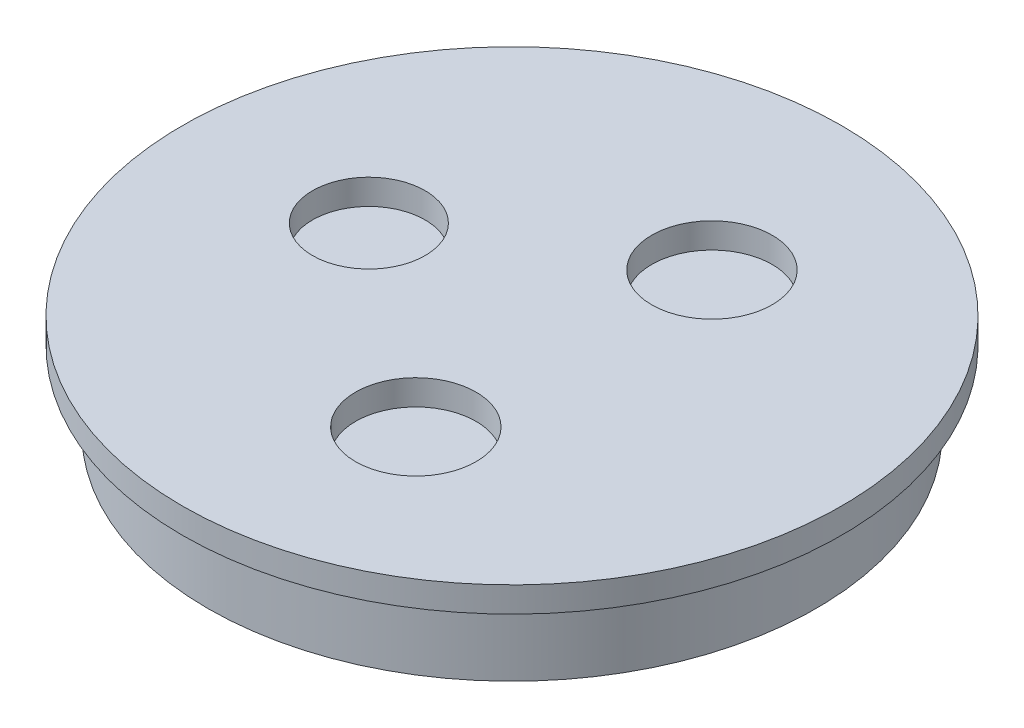
ISO-10303-21;
HEADER;
FILE_DESCRIPTION(('STEP AP214'),'2;1');
FILE_NAME('part.step','',(''),(''),'','','');
FILE_SCHEMA(('AUTOMOTIVE_DESIGN { 1 0 10303 214 1 1 1 1 }'));
ENDSEC;
DATA;
#1=APPLICATION_CONTEXT('core data for automotive mechanical design processes');
#2=APPLICATION_PROTOCOL_DEFINITION('international standard','automotive_design',2000,#1);
#3=PRODUCT_CONTEXT('',#1,'mechanical');
#4=PRODUCT('Part','Part','',(#3));
#5=PRODUCT_RELATED_PRODUCT_CATEGORY('part','',(#4));
#6=PRODUCT_DEFINITION_FORMATION('','',#4);
#7=PRODUCT_DEFINITION_CONTEXT('part definition',#1,'design');
#8=PRODUCT_DEFINITION('design','',#6,#7);
#9=PRODUCT_DEFINITION_SHAPE('','',#8);
#10=(LENGTH_UNIT() NAMED_UNIT(*) SI_UNIT(.MILLI.,.METRE.));
#11=(NAMED_UNIT(*) PLANE_ANGLE_UNIT() SI_UNIT($,.RADIAN.));
#12=(NAMED_UNIT(*) SI_UNIT($,.STERADIAN.) SOLID_ANGLE_UNIT());
#13=UNCERTAINTY_MEASURE_WITH_UNIT(LENGTH_MEASURE(1.E-05),#10,'distance_accuracy_value','');
#14=(GEOMETRIC_REPRESENTATION_CONTEXT(3) GLOBAL_UNCERTAINTY_ASSIGNED_CONTEXT((#13)) GLOBAL_UNIT_ASSIGNED_CONTEXT((#10,
#11,#12)) REPRESENTATION_CONTEXT('',''));
#15=CARTESIAN_POINT('',(0.,0.,0.));
#16=DIRECTION('',(0.,0.,1.));
#17=DIRECTION('',(1.,0.,0.));
#18=AXIS2_PLACEMENT_3D('',#15,#16,#17);
#19=CARTESIAN_POINT('',(0.,0.,0.));
#20=DIRECTION('',(0.,1.,0.));
#21=DIRECTION('',(0.,0.,1.));
#22=AXIS2_PLACEMENT_3D('',#19,#20,#21);
#23=PLANE('',#22);
#24=CARTESIAN_POINT('',(0.,0.,0.));
#25=DIRECTION('',(0.,1.,0.));
#26=DIRECTION('',(0.,0.,1.));
#27=AXIS2_PLACEMENT_3D('',#24,#25,#26);
#28=CIRCLE('',#27,41.275);
#29=CARTESIAN_POINT('',(0.,0.,41.275));
#30=VERTEX_POINT('',#29);
#31=EDGE_CURVE('E42',#30,#30,#28,.T.);
#32=ORIENTED_EDGE('',*,*,#31,.F.);
#33=EDGE_LOOP('',(#32));
#34=FACE_BOUND('',#33,.T.);
#35=CARTESIAN_POINT('',(0.,0.,0.));
#36=DIRECTION('',(0.,1.,0.));
#37=DIRECTION('',(0.,0.,1.));
#38=AXIS2_PLACEMENT_3D('',#35,#36,#37);
#39=CIRCLE('',#38,38.1);
#40=CARTESIAN_POINT('',(0.,0.,38.1));
#41=VERTEX_POINT('',#40);
#42=EDGE_CURVE('E10',#41,#41,#39,.F.);
#43=ORIENTED_EDGE('',*,*,#42,.F.);
#44=EDGE_LOOP('',(#43));
#45=FACE_BOUND('',#44,.T.);
#46=ADVANCED_FACE('F31',(#34,#45),#23,.F.);
#47=CARTESIAN_POINT('',(0.,3.175,0.));
#48=DIRECTION('',(0.,1.,0.));
#49=DIRECTION('',(0.,0.,1.));
#50=AXIS2_PLACEMENT_3D('',#47,#48,#49);
#51=PLANE('',#50);
#52=CARTESIAN_POINT('',(6.02571844219513,3.175,18.0718902513099));
#53=DIRECTION('',(0.,1.,0.));
#54=DIRECTION('',(0.,0.,1.));
#55=AXIS2_PLACEMENT_3D('',#52,#53,#54);
#56=CIRCLE('',#55,7.55);
#57=CARTESIAN_POINT('',(6.02571844219513,3.175,25.6218902513099));
#58=VERTEX_POINT('',#57);
#59=EDGE_CURVE('E52',#58,#58,#56,.T.);
#60=ORIENTED_EDGE('',*,*,#59,.F.);
#61=EDGE_LOOP('',(#60));
#62=FACE_BOUND('',#61,.T.);
#63=CARTESIAN_POINT('',(0.,3.175,0.));
#64=DIRECTION('',(0.,1.,0.));
#65=DIRECTION('',(0.,0.,1.));
#66=AXIS2_PLACEMENT_3D('',#63,#64,#65);
#67=CIRCLE('',#66,41.275);
#68=CARTESIAN_POINT('',(0.,3.175,41.275));
#69=VERTEX_POINT('',#68);
#70=EDGE_CURVE('E38',#69,#69,#67,.T.);
#71=ORIENTED_EDGE('',*,*,#70,.T.);
#72=EDGE_LOOP('',(#71));
#73=FACE_BOUND('',#72,.T.);
#74=CARTESIAN_POINT('',(-19.0188478283971,3.175,-1.08900288350165));
#75=DIRECTION('',(0.,1.,0.));
#76=DIRECTION('',(0.,0.,1.));
#77=AXIS2_PLACEMENT_3D('',#74,#75,#76);
#78=CIRCLE('',#77,7.05);
#79=CARTESIAN_POINT('',(-19.0188478283971,3.175,5.96099711649835));
#80=VERTEX_POINT('',#79);
#81=EDGE_CURVE('E47',#80,#80,#78,.T.);
#82=ORIENTED_EDGE('',*,*,#81,.F.);
#83=EDGE_LOOP('',(#82));
#84=FACE_BOUND('',#83,.T.);
#85=CARTESIAN_POINT('',(7.55083057647846,3.175,-17.4896385784646));
#86=DIRECTION('',(0.,1.,0.));
#87=DIRECTION('',(0.,0.,1.));
#88=AXIS2_PLACEMENT_3D('',#85,#86,#87);
#89=CIRCLE('',#88,7.55);
#90=CARTESIAN_POINT('',(7.55083057647846,3.175,-9.93963857846462));
#91=VERTEX_POINT('',#90);
#92=EDGE_CURVE('E58',#91,#91,#89,.T.);
#93=ORIENTED_EDGE('',*,*,#92,.F.);
#94=EDGE_LOOP('',(#93));
#95=FACE_BOUND('',#94,.T.);
#96=ADVANCED_FACE('F87',(#62,#73,#84,#95),#51,.T.);
#97=CARTESIAN_POINT('',(0.,3.175,0.));
#98=DIRECTION('',(0.,-1.,0.));
#99=DIRECTION('',(0.,0.,-1.));
#100=AXIS2_PLACEMENT_3D('',#97,#98,#99);
#101=CYLINDRICAL_SURFACE('',#100,41.275);
#102=ORIENTED_EDGE('',*,*,#70,.F.);
#103=EDGE_LOOP('',(#102));
#104=FACE_BOUND('',#103,.T.);
#105=ORIENTED_EDGE('',*,*,#31,.T.);
#106=EDGE_LOOP('',(#105));
#107=FACE_BOUND('',#106,.T.);
#108=ADVANCED_FACE('F33',(#104,#107),#101,.T.);
#109=CARTESIAN_POINT('',(-19.0188478283971,3.175,-1.08900288350165));
#110=DIRECTION('',(0.,-1.,0.));
#111=DIRECTION('',(0.,0.,-1.));
#112=AXIS2_PLACEMENT_3D('',#109,#110,#111);
#113=CYLINDRICAL_SURFACE('',#112,7.05);
#114=ORIENTED_EDGE('',*,*,#81,.T.);
#115=EDGE_LOOP('',(#114));
#116=FACE_BOUND('',#115,.T.);
#117=CARTESIAN_POINT('',(-19.0188478283971,0.,-1.08900288350165));
#118=DIRECTION('',(0.,1.,0.));
#119=DIRECTION('',(0.,0.,1.));
#120=AXIS2_PLACEMENT_3D('',#117,#118,#119);
#121=CIRCLE('',#120,7.05);
#122=CARTESIAN_POINT('',(-19.0188478283971,0.,5.96099711649835));
#123=VERTEX_POINT('',#122);
#124=EDGE_CURVE('E49',#123,#123,#121,.T.);
#125=ORIENTED_EDGE('',*,*,#124,.F.);
#126=EDGE_LOOP('',(#125));
#127=FACE_BOUND('',#126,.T.);
#128=ADVANCED_FACE('F97',(#116,#127),#113,.F.);
#129=CARTESIAN_POINT('',(6.02571844219513,3.175,18.0718902513099));
#130=DIRECTION('',(0.,-1.,0.));
#131=DIRECTION('',(0.,0.,-1.));
#132=AXIS2_PLACEMENT_3D('',#129,#130,#131);
#133=CYLINDRICAL_SURFACE('',#132,7.55);
#134=ORIENTED_EDGE('',*,*,#59,.T.);
#135=EDGE_LOOP('',(#134));
#136=FACE_BOUND('',#135,.T.);
#137=CARTESIAN_POINT('',(6.02571844219513,0.,18.0718902513099));
#138=DIRECTION('',(0.,1.,0.));
#139=DIRECTION('',(0.,0.,1.));
#140=AXIS2_PLACEMENT_3D('',#137,#138,#139);
#141=CIRCLE('',#140,7.55);
#142=CARTESIAN_POINT('',(6.02571844219513,0.,25.6218902513099));
#143=VERTEX_POINT('',#142);
#144=EDGE_CURVE('E55',#143,#143,#141,.T.);
#145=ORIENTED_EDGE('',*,*,#144,.F.);
#146=EDGE_LOOP('',(#145));
#147=FACE_BOUND('',#146,.T.);
#148=ADVANCED_FACE('F100',(#136,#147),#133,.F.);
#149=CARTESIAN_POINT('',(7.55083057647846,3.175,-17.4896385784646));
#150=DIRECTION('',(0.,-1.,0.));
#151=DIRECTION('',(0.,0.,-1.));
#152=AXIS2_PLACEMENT_3D('',#149,#150,#151);
#153=CYLINDRICAL_SURFACE('',#152,7.55);
#154=ORIENTED_EDGE('',*,*,#92,.T.);
#155=EDGE_LOOP('',(#154));
#156=FACE_BOUND('',#155,.T.);
#157=CARTESIAN_POINT('',(7.55083057647846,0.,-17.4896385784646));
#158=DIRECTION('',(0.,1.,0.));
#159=DIRECTION('',(0.,0.,1.));
#160=AXIS2_PLACEMENT_3D('',#157,#158,#159);
#161=CIRCLE('',#160,7.55);
#162=CARTESIAN_POINT('',(7.55083057647846,0.,-9.93963857846462));
#163=VERTEX_POINT('',#162);
#164=EDGE_CURVE('E61',#163,#163,#161,.T.);
#165=ORIENTED_EDGE('',*,*,#164,.F.);
#166=EDGE_LOOP('',(#165));
#167=FACE_BOUND('',#166,.T.);
#168=ADVANCED_FACE('F103',(#156,#167),#153,.F.);
#169=CARTESIAN_POINT('',(0.,0.,0.));
#170=DIRECTION('',(0.,-1.,0.));
#171=DIRECTION('',(0.,0.,-1.));
#172=AXIS2_PLACEMENT_3D('',#169,#170,#171);
#173=PLANE('',#172);
#174=ORIENTED_EDGE('',*,*,#164,.T.);
#175=EDGE_LOOP('',(#174));
#176=FACE_BOUND('',#175,.T.);
#177=ADVANCED_FACE('F84',(#176),#173,.F.);
#178=ORIENTED_EDGE('',*,*,#144,.T.);
#179=EDGE_LOOP('',(#178));
#180=FACE_BOUND('',#179,.T.);
#181=ADVANCED_FACE('F81',(#180),#173,.F.);
#182=ORIENTED_EDGE('',*,*,#124,.T.);
#183=EDGE_LOOP('',(#182));
#184=FACE_BOUND('',#183,.T.);
#185=ADVANCED_FACE('F74',(#184),#173,.F.);
#186=CARTESIAN_POINT('',(0.,-9.525,0.));
#187=DIRECTION('',(0.,1.,0.));
#188=DIRECTION('',(0.,0.,1.));
#189=AXIS2_PLACEMENT_3D('',#186,#187,#188);
#190=CYLINDRICAL_SURFACE('',#189,38.1);
#191=CARTESIAN_POINT('',(0.,-9.525,0.));
#192=DIRECTION('',(0.,-1.,0.));
#193=DIRECTION('',(0.,0.,-1.));
#194=AXIS2_PLACEMENT_3D('',#191,#192,#193);
#195=CIRCLE('',#194,38.1);
#196=CARTESIAN_POINT('',(0.,-9.525,-38.1));
#197=VERTEX_POINT('',#196);
#198=EDGE_CURVE('E64',#197,#197,#195,.T.);
#199=ORIENTED_EDGE('',*,*,#198,.F.);
#200=EDGE_LOOP('',(#199));
#201=FACE_BOUND('',#200,.T.);
#202=ORIENTED_EDGE('',*,*,#42,.T.);
#203=EDGE_LOOP('',(#202));
#204=FACE_BOUND('',#203,.T.);
#205=ADVANCED_FACE('F72',(#201,#204),#190,.T.);
#206=CARTESIAN_POINT('',(0.,-9.525,0.));
#207=DIRECTION('',(0.,-1.,0.));
#208=DIRECTION('',(0.,0.,-1.));
#209=AXIS2_PLACEMENT_3D('',#206,#207,#208);
#210=PLANE('',#209);
#211=ORIENTED_EDGE('',*,*,#198,.T.);
#212=EDGE_LOOP('',(#211));
#213=FACE_BOUND('',#212,.T.);
#214=ADVANCED_FACE('F70',(#213),#210,.T.);
#215=CLOSED_SHELL('',(#46,#96,#108,#128,#148,#168,#177,#181,#185,#205,#214));
#216=MANIFOLD_SOLID_BREP('B2',#215);
#217=ADVANCED_BREP_SHAPE_REPRESENTATION('',(#18,#216),#14);
#218=SHAPE_DEFINITION_REPRESENTATION(#9,#217);
ENDSEC;
END-ISO-10303-21;
